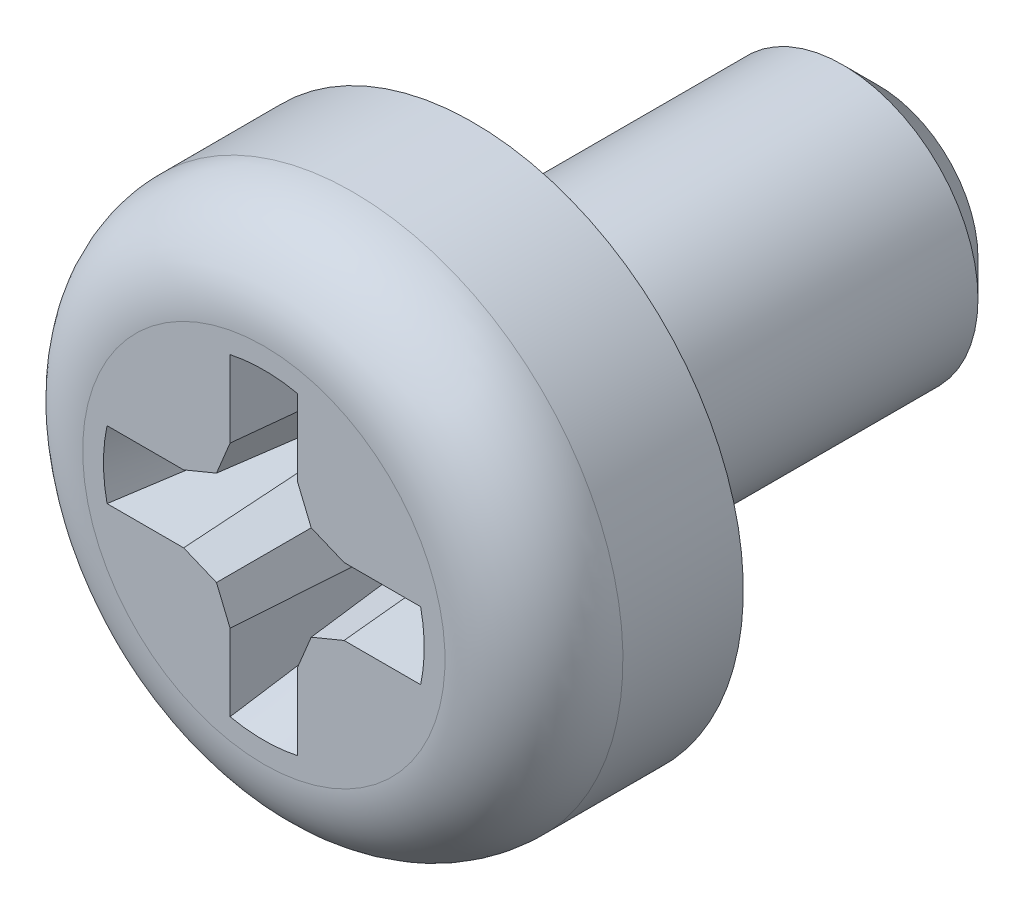
ISO-10303-21;
HEADER;
FILE_DESCRIPTION(('STEP AP214'),'2;1');
FILE_NAME('part.step','',(''),(''),'','','');
FILE_SCHEMA(('AUTOMOTIVE_DESIGN { 1 0 10303 214 1 1 1 1 }'));
ENDSEC;
DATA;
#1=APPLICATION_CONTEXT('core data for automotive mechanical design processes');
#2=APPLICATION_PROTOCOL_DEFINITION('international standard','automotive_design',2000,#1);
#3=PRODUCT_CONTEXT('',#1,'mechanical');
#4=PRODUCT('Part','Part','',(#3));
#5=PRODUCT_RELATED_PRODUCT_CATEGORY('part','',(#4));
#6=PRODUCT_DEFINITION_FORMATION('','',#4);
#7=PRODUCT_DEFINITION_CONTEXT('part definition',#1,'design');
#8=PRODUCT_DEFINITION('design','',#6,#7);
#9=PRODUCT_DEFINITION_SHAPE('','',#8);
#10=(LENGTH_UNIT() NAMED_UNIT(*) SI_UNIT(.MILLI.,.METRE.));
#11=(NAMED_UNIT(*) PLANE_ANGLE_UNIT() SI_UNIT($,.RADIAN.));
#12=(NAMED_UNIT(*) SI_UNIT($,.STERADIAN.) SOLID_ANGLE_UNIT());
#13=UNCERTAINTY_MEASURE_WITH_UNIT(LENGTH_MEASURE(1.E-05),#10,'distance_accuracy_value','');
#14=(GEOMETRIC_REPRESENTATION_CONTEXT(3) GLOBAL_UNCERTAINTY_ASSIGNED_CONTEXT((#13)) GLOBAL_UNIT_ASSIGNED_CONTEXT((#10,
#11,#12)) REPRESENTATION_CONTEXT('',''));
#15=CARTESIAN_POINT('',(0.,0.,0.));
#16=DIRECTION('',(0.,0.,1.));
#17=DIRECTION('',(1.,0.,0.));
#18=AXIS2_PLACEMENT_3D('',#15,#16,#17);
#19=CARTESIAN_POINT('',(0.,0.,0.));
#20=DIRECTION('',(0.,0.,1.));
#21=DIRECTION('',(1.,0.,0.));
#22=AXIS2_PLACEMENT_3D('',#19,#20,#21);
#23=PLANE('',#22);
#24=CARTESIAN_POINT('',(0.,0.,0.));
#25=DIRECTION('',(0.,0.,1.));
#26=DIRECTION('',(1.,0.,0.));
#27=AXIS2_PLACEMENT_3D('',#24,#25,#26);
#28=CIRCLE('',#27,4.);
#29=CARTESIAN_POINT('',(-4.,0.,0.));
#30=VERTEX_POINT('',#29);
#31=EDGE_CURVE('E56',#30,#30,#28,.T.);
#32=ORIENTED_EDGE('',*,*,#31,.F.);
#33=EDGE_LOOP('',(#32));
#34=FACE_BOUND('',#33,.T.);
#35=CARTESIAN_POINT('',(0.,0.,0.));
#36=DIRECTION('',(0.,0.,1.));
#37=DIRECTION('',(1.,0.,0.));
#38=AXIS2_PLACEMENT_3D('',#35,#36,#37);
#39=CIRCLE('',#38,2.);
#40=CARTESIAN_POINT('',(2.,0.,0.));
#41=VERTEX_POINT('',#40);
#42=EDGE_CURVE('E11',#41,#41,#39,.F.);
#43=ORIENTED_EDGE('',*,*,#42,.F.);
#44=EDGE_LOOP('',(#43));
#45=FACE_BOUND('',#44,.T.);
#46=ADVANCED_FACE('F39',(#34,#45),#23,.F.);
#47=CARTESIAN_POINT('',(0.,0.,3.1));
#48=DIRECTION('',(0.,0.,-1.));
#49=DIRECTION('',(-1.,0.,0.));
#50=AXIS2_PLACEMENT_3D('',#47,#48,#49);
#51=CYLINDRICAL_SURFACE('',#50,4.);
#52=CARTESIAN_POINT('',(0.,0.,1.7825));
#53=DIRECTION('',(0.,0.,-1.));
#54=DIRECTION('',(0.,1.,0.));
#55=AXIS2_PLACEMENT_3D('',#52,#53,#54);
#56=CIRCLE('',#55,4.);
#57=CARTESIAN_POINT('',(-4.,0.,1.7825));
#58=VERTEX_POINT('',#57);
#59=EDGE_CURVE('E456',#58,#58,#56,.T.);
#60=CARTESIAN_POINT('',(-4.,0.,1.7825));
#61=CARTESIAN_POINT('',(-4.,0.,1.76393229166667));
#62=CARTESIAN_POINT('',(-4.,0.,1.74536458333333));
#63=CARTESIAN_POINT('',(-4.,0.,1.70822916666667));
#64=CARTESIAN_POINT('',(-4.,0.,1.68966145833333));
#65=CARTESIAN_POINT('',(-4.,0.,1.65252604166667));
#66=CARTESIAN_POINT('',(-4.,0.,1.63395833333333));
#67=CARTESIAN_POINT('',(-4.,0.,1.59682291666667));
#68=CARTESIAN_POINT('',(-4.,0.,1.57825520833333));
#69=CARTESIAN_POINT('',(-4.,0.,1.54111979166667));
#70=CARTESIAN_POINT('',(-4.,0.,1.52255208333333));
#71=CARTESIAN_POINT('',(-4.,0.,1.48541666666667));
#72=CARTESIAN_POINT('',(-4.,0.,1.46684895833333));
#73=CARTESIAN_POINT('',(-4.,0.,1.42971354166667));
#74=CARTESIAN_POINT('',(-4.,0.,1.41114583333333));
#75=CARTESIAN_POINT('',(-4.,0.,1.37401041666667));
#76=CARTESIAN_POINT('',(-4.,0.,1.35544270833333));
#77=CARTESIAN_POINT('',(-4.,0.,1.31830729166667));
#78=CARTESIAN_POINT('',(-4.,0.,1.29973958333333));
#79=CARTESIAN_POINT('',(-4.,0.,1.26260416666667));
#80=CARTESIAN_POINT('',(-4.,0.,1.24403645833333));
#81=CARTESIAN_POINT('',(-4.,0.,1.20690104166667));
#82=CARTESIAN_POINT('',(-4.,0.,1.18833333333333));
#83=CARTESIAN_POINT('',(-4.,0.,1.15119791666667));
#84=CARTESIAN_POINT('',(-4.,0.,1.13263020833333));
#85=CARTESIAN_POINT('',(-4.,0.,1.09549479166667));
#86=CARTESIAN_POINT('',(-4.,0.,1.07692708333333));
#87=CARTESIAN_POINT('',(-4.,0.,1.03979166666667));
#88=CARTESIAN_POINT('',(-4.,0.,1.02122395833333));
#89=CARTESIAN_POINT('',(-4.,0.,0.984088541666667));
#90=CARTESIAN_POINT('',(-4.,0.,0.965520833333333));
#91=CARTESIAN_POINT('',(-4.,0.,0.928385416666666));
#92=CARTESIAN_POINT('',(-4.,0.,0.909817708333333));
#93=CARTESIAN_POINT('',(-4.,0.,0.872682291666666));
#94=CARTESIAN_POINT('',(-4.,0.,0.854114583333333));
#95=CARTESIAN_POINT('',(-4.,0.,0.816979166666667));
#96=CARTESIAN_POINT('',(-4.,0.,0.798411458333333));
#97=CARTESIAN_POINT('',(-4.,0.,0.761276041666667));
#98=CARTESIAN_POINT('',(-4.,0.,0.742708333333333));
#99=CARTESIAN_POINT('',(-4.,0.,0.705572916666667));
#100=CARTESIAN_POINT('',(-4.,0.,0.687005208333333));
#101=CARTESIAN_POINT('',(-4.,0.,0.649869791666667));
#102=CARTESIAN_POINT('',(-4.,0.,0.631302083333333));
#103=CARTESIAN_POINT('',(-4.,0.,0.594166666666667));
#104=CARTESIAN_POINT('',(-4.,0.,0.575598958333333));
#105=CARTESIAN_POINT('',(-4.,0.,0.538463541666667));
#106=CARTESIAN_POINT('',(-4.,0.,0.519895833333333));
#107=CARTESIAN_POINT('',(-4.,0.,0.482760416666667));
#108=CARTESIAN_POINT('',(-4.,0.,0.464192708333333));
#109=CARTESIAN_POINT('',(-4.,0.,0.427057291666667));
#110=CARTESIAN_POINT('',(-4.,0.,0.408489583333333));
#111=CARTESIAN_POINT('',(-4.,0.,0.371354166666667));
#112=CARTESIAN_POINT('',(-4.,0.,0.352786458333333));
#113=CARTESIAN_POINT('',(-4.,0.,0.315651041666667));
#114=CARTESIAN_POINT('',(-4.,0.,0.297083333333333));
#115=CARTESIAN_POINT('',(-4.,0.,0.259947916666666));
#116=CARTESIAN_POINT('',(-4.,0.,0.241380208333333));
#117=CARTESIAN_POINT('',(-4.,0.,0.204244791666667));
#118=CARTESIAN_POINT('',(-4.,0.,0.185677083333333));
#119=CARTESIAN_POINT('',(-4.,0.,0.148541666666667));
#120=CARTESIAN_POINT('',(-4.,0.,0.129973958333333));
#121=CARTESIAN_POINT('',(-4.,0.,0.0928385416666666));
#122=CARTESIAN_POINT('',(-4.,0.,0.0742708333333332));
#123=CARTESIAN_POINT('',(-4.,0.,0.0371354166666665));
#124=CARTESIAN_POINT('',(-4.,0.,0.0185677083333332));
#125=CARTESIAN_POINT('',(-4.,0.,0.));
#126=B_SPLINE_CURVE_WITH_KNOTS('',3,(#60,#61,#62,#63,#64,#65,#66,#67,#68,#69,#70,#71,#72,#73,
#74,#75,#76,#77,#78,#79,#80,#81,#82,#83,#84,#85,#86,#87,#88,#89,#90,#91,#92,#93,#94,#95,#96,#97,
#98,#99,#100,#101,#102,#103,#104,#105,#106,#107,#108,#109,#110,#111,#112,#113,#114,#115,#116,
#117,#118,#119,#120,#121,#122,#123,#124,#125),.UNSPECIFIED.,.F.,.F.,(4,2,2,2,2,2,2,2,2,2,2,2,2,
2,2,2,2,2,2,2,2,2,2,2,2,2,2,2,2,2,2,2,4),(0.,0.055703125,0.11140625,0.167109375,0.2228125,
0.278515625,0.33421875,0.389921875,0.445625,0.501328125,0.55703125,0.612734375,0.6684375,
0.724140625,0.77984375,0.835546875,0.89125,0.946953125,1.00265625,1.058359375,1.1140625,
1.169765625,1.22546875,1.281171875,1.336875,1.392578125,1.44828125,1.503984375,1.5596875,
1.615390625,1.67109375,1.726796875,1.7825),.UNSPECIFIED.);
#127=EDGE_CURVE('BSEAM382',#58,#30,#126,.T.);
#128=ORIENTED_EDGE('',*,*,#59,.T.);
#129=ORIENTED_EDGE('',*,*,#31,.T.);
#130=ORIENTED_EDGE('',*,*,#127,.T.);
#131=ORIENTED_EDGE('',*,*,#127,.F.);
#132=EDGE_LOOP('',(#128,#130,#129,#131));
#133=FACE_BOUND('',#132,.T.);
#134=ADVANCED_FACE('F382',(#133),#51,.T.);
#135=CARTESIAN_POINT('',(0.,0.,1.7825));
#136=DIRECTION('',(0.,0.,-1.));
#137=DIRECTION('',(0.,1.,0.));
#138=AXIS2_PLACEMENT_3D('',#135,#136,#137);
#139=TOROIDAL_SURFACE('',#138,2.6825,1.3175);
#140=ORIENTED_EDGE('',*,*,#59,.F.);
#141=EDGE_LOOP('',(#140));
#142=FACE_BOUND('',#141,.T.);
#143=CARTESIAN_POINT('',(0.,0.,3.1));
#144=DIRECTION('',(0.,0.,-1.));
#145=DIRECTION('',(0.,1.,0.));
#146=AXIS2_PLACEMENT_3D('',#143,#144,#145);
#147=CIRCLE('',#146,2.6825);
#148=CARTESIAN_POINT('',(0.,2.6825,3.1));
#149=VERTEX_POINT('',#148);
#150=EDGE_CURVE('E452',#149,#149,#147,.T.);
#151=ORIENTED_EDGE('',*,*,#150,.T.);
#152=EDGE_LOOP('',(#151));
#153=FACE_BOUND('',#152,.T.);
#154=ADVANCED_FACE('F388',(#142,#153),#139,.T.);
#155=CARTESIAN_POINT('',(0.,0.,3.1));
#156=DIRECTION('',(0.,0.,1.));
#157=DIRECTION('',(1.,0.,0.));
#158=AXIS2_PLACEMENT_3D('',#155,#156,#157);
#159=PLANE('',#158);
#160=DIRECTION('',(0.,-1.,0.));
#161=VECTOR('',#160,1.);
#162=CARTESIAN_POINT('',(-0.500000000000005,1.1875,3.1));
#163=LINE('',#162,#161);
#164=CARTESIAN_POINT('',(-0.500000000000009,2.32177195262584,3.1));
#165=VERTEX_POINT('',#164);
#166=CARTESIAN_POINT('',(-0.500000000000005,1.1875,3.1));
#167=VERTEX_POINT('',#166);
#168=EDGE_CURVE('E337',#165,#167,#163,.T.);
#169=ORIENTED_EDGE('',*,*,#168,.F.);
#170=CARTESIAN_POINT('',(0.,0.,3.1));
#171=DIRECTION('',(0.,0.,1.));
#172=DIRECTION('',(1.,0.,0.));
#173=AXIS2_PLACEMENT_3D('',#170,#171,#172);
#174=CIRCLE('',#173,2.375);
#175=CARTESIAN_POINT('',(0.5,2.32177195262584,3.1));
#176=VERTEX_POINT('',#175);
#177=EDGE_CURVE('E344',#176,#165,#174,.T.);
#178=ORIENTED_EDGE('',*,*,#177,.F.);
#179=DIRECTION('',(0.,1.,0.));
#180=VECTOR('',#179,1.);
#181=CARTESIAN_POINT('',(0.5,2.32177195262584,3.1));
#182=LINE('',#181,#180);
#183=CARTESIAN_POINT('',(0.5,1.1875,3.1));
#184=VERTEX_POINT('',#183);
#185=EDGE_CURVE('E440',#184,#176,#182,.T.);
#186=ORIENTED_EDGE('',*,*,#185,.F.);
#187=DIRECTION('',(-0.382683432365083,0.923879532511289,0.));
#188=VECTOR('',#187,1.);
#189=CARTESIAN_POINT('',(0.5,1.1875,3.1));
#190=LINE('',#189,#188);
#191=CARTESIAN_POINT('',(0.701364087934246,0.701364087934246,3.1));
#192=VERTEX_POINT('',#191);
#193=EDGE_CURVE('E434',#192,#184,#190,.T.);
#194=ORIENTED_EDGE('',*,*,#193,.F.);
#195=DIRECTION('',(-0.92387953251129,0.382683432365083,0.));
#196=VECTOR('',#195,1.);
#197=CARTESIAN_POINT('',(1.1875,0.500000000000001,3.1));
#198=LINE('',#197,#196);
#199=CARTESIAN_POINT('',(1.1875,0.500000000000001,3.1));
#200=VERTEX_POINT('',#199);
#201=EDGE_CURVE('E193',#200,#192,#198,.T.);
#202=ORIENTED_EDGE('',*,*,#201,.F.);
#203=DIRECTION('',(-1.,0.,0.));
#204=VECTOR('',#203,1.);
#205=CARTESIAN_POINT('',(1.1875,0.500000000000001,3.1));
#206=LINE('',#205,#204);
#207=CARTESIAN_POINT('',(2.32177195262584,0.500000000000001,3.1));
#208=VERTEX_POINT('',#207);
#209=EDGE_CURVE('E426',#208,#200,#206,.T.);
#210=ORIENTED_EDGE('',*,*,#209,.F.);
#211=CARTESIAN_POINT('',(0.,0.,3.1));
#212=DIRECTION('',(0.,0.,1.));
#213=DIRECTION('',(1.,0.,0.));
#214=AXIS2_PLACEMENT_3D('',#211,#212,#213);
#215=CIRCLE('',#214,2.375);
#216=CARTESIAN_POINT('',(2.32177195262584,-0.499999999999976,3.1));
#217=VERTEX_POINT('',#216);
#218=EDGE_CURVE('E290',#217,#208,#215,.T.);
#219=ORIENTED_EDGE('',*,*,#218,.F.);
#220=DIRECTION('',(1.,0.,0.));
#221=VECTOR('',#220,1.);
#222=CARTESIAN_POINT('',(2.32177195262584,-0.499999999999976,3.1));
#223=LINE('',#222,#221);
#224=CARTESIAN_POINT('',(1.1875,-0.499999999999988,3.1));
#225=VERTEX_POINT('',#224);
#226=EDGE_CURVE('E519',#225,#217,#223,.T.);
#227=ORIENTED_EDGE('',*,*,#226,.F.);
#228=DIRECTION('',(0.923879532511285,0.382683432365093,0.));
#229=VECTOR('',#228,1.);
#230=CARTESIAN_POINT('',(1.1875,-0.499999999999988,3.1));
#231=LINE('',#230,#229);
#232=CARTESIAN_POINT('',(0.701364087934254,-0.701364087934238,3.1));
#233=VERTEX_POINT('',#232);
#234=EDGE_CURVE('E522',#233,#225,#231,.T.);
#235=ORIENTED_EDGE('',*,*,#234,.F.);
#236=DIRECTION('',(0.382683432365073,0.923879532511294,0.));
#237=VECTOR('',#236,1.);
#238=CARTESIAN_POINT('',(0.500000000000013,-1.18749999999999,3.1));
#239=LINE('',#238,#237);
#240=CARTESIAN_POINT('',(0.500000000000013,-1.18749999999999,3.1));
#241=VERTEX_POINT('',#240);
#242=EDGE_CURVE('E525',#241,#233,#239,.T.);
#243=ORIENTED_EDGE('',*,*,#242,.F.);
#244=DIRECTION('',(0.,1.,0.));
#245=VECTOR('',#244,1.);
#246=CARTESIAN_POINT('',(0.500000000000013,-1.18749999999999,3.1));
#247=LINE('',#246,#245);
#248=CARTESIAN_POINT('',(0.500000000000025,-2.32177195262583,3.1));
#249=VERTEX_POINT('',#248);
#250=EDGE_CURVE('E528',#249,#241,#247,.T.);
#251=ORIENTED_EDGE('',*,*,#250,.F.);
#252=CARTESIAN_POINT('',(0.,0.,3.1));
#253=DIRECTION('',(0.,0.,1.));
#254=DIRECTION('',(-1.,0.,0.));
#255=AXIS2_PLACEMENT_3D('',#252,#253,#254);
#256=CIRCLE('',#255,2.375);
#257=CARTESIAN_POINT('',(-0.499999999999984,-2.32177195262584,3.1));
#258=VERTEX_POINT('',#257);
#259=EDGE_CURVE('E499',#258,#249,#256,.T.);
#260=ORIENTED_EDGE('',*,*,#259,.F.);
#261=DIRECTION('',(0.,-1.,0.));
#262=VECTOR('',#261,1.);
#263=CARTESIAN_POINT('',(-0.499999999999984,-2.32177195262584,3.1));
#264=LINE('',#263,#262);
#265=CARTESIAN_POINT('',(-0.499999999999992,-1.1875,3.1));
#266=VERTEX_POINT('',#265);
#267=EDGE_CURVE('E503',#266,#258,#264,.T.);
#268=ORIENTED_EDGE('',*,*,#267,.F.);
#269=DIRECTION('',(0.382683432365089,-0.923879532511287,0.));
#270=VECTOR('',#269,1.);
#271=CARTESIAN_POINT('',(-0.499999999999992,-1.1875,3.1));
#272=LINE('',#271,#270);
#273=CARTESIAN_POINT('',(-0.701364087934241,-0.701364087934251,3.1));
#274=VERTEX_POINT('',#273);
#275=EDGE_CURVE('E507',#274,#266,#272,.T.);
#276=ORIENTED_EDGE('',*,*,#275,.F.);
#277=DIRECTION('',(0.923879532511292,-0.382683432365076,0.));
#278=VECTOR('',#277,1.);
#279=CARTESIAN_POINT('',(-1.1875,-0.500000000000009,3.1));
#280=LINE('',#279,#278);
#281=CARTESIAN_POINT('',(-1.1875,-0.500000000000009,3.1));
#282=VERTEX_POINT('',#281);
#283=EDGE_CURVE('E511',#282,#274,#280,.T.);
#284=ORIENTED_EDGE('',*,*,#283,.F.);
#285=DIRECTION('',(1.,0.,0.));
#286=VECTOR('',#285,1.);
#287=CARTESIAN_POINT('',(-1.1875,-0.500000000000009,3.1));
#288=LINE('',#287,#286);
#289=CARTESIAN_POINT('',(-2.32177195262584,-0.500000000000017,3.1));
#290=VERTEX_POINT('',#289);
#291=EDGE_CURVE('E515',#290,#282,#288,.T.);
#292=ORIENTED_EDGE('',*,*,#291,.F.);
#293=CARTESIAN_POINT('',(0.,0.,3.1));
#294=DIRECTION('',(0.,0.,1.));
#295=DIRECTION('',(0.,1.,0.));
#296=AXIS2_PLACEMENT_3D('',#293,#294,#295);
#297=CIRCLE('',#296,2.375);
#298=CARTESIAN_POINT('',(-2.32177195262584,0.499999999999992,3.1));
#299=VERTEX_POINT('',#298);
#300=EDGE_CURVE('E138',#299,#290,#297,.T.);
#301=ORIENTED_EDGE('',*,*,#300,.F.);
#302=DIRECTION('',(-1.,0.,0.));
#303=VECTOR('',#302,1.);
#304=CARTESIAN_POINT('',(-2.32177195262584,0.499999999999992,3.1));
#305=LINE('',#304,#303);
#306=CARTESIAN_POINT('',(-1.1875,0.499999999999996,3.1));
#307=VERTEX_POINT('',#306);
#308=EDGE_CURVE('E484',#307,#299,#305,.T.);
#309=ORIENTED_EDGE('',*,*,#308,.F.);
#310=DIRECTION('',(-0.923879532511288,-0.382683432365086,0.));
#311=VECTOR('',#310,1.);
#312=CARTESIAN_POINT('',(-1.1875,0.499999999999996,3.1));
#313=LINE('',#312,#311);
#314=CARTESIAN_POINT('',(-0.701364087934249,0.701364087934243,3.1));
#315=VERTEX_POINT('',#314);
#316=EDGE_CURVE('E487',#315,#307,#313,.T.);
#317=ORIENTED_EDGE('',*,*,#316,.F.);
#318=DIRECTION('',(-0.38268343236508,-0.923879532511291,0.));
#319=VECTOR('',#318,1.);
#320=CARTESIAN_POINT('',(-0.500000000000005,1.1875,3.1));
#321=LINE('',#320,#319);
#322=EDGE_CURVE('E493',#167,#315,#321,.T.);
#323=ORIENTED_EDGE('',*,*,#322,.F.);
#324=EDGE_LOOP('',(#169,#178,#186,#194,#202,#210,#219,#227,#235,#243,#251,#260,#268,#276,#284,
#292,#301,#309,#317,#323));
#325=FACE_BOUND('',#324,.T.);
#326=ORIENTED_EDGE('',*,*,#150,.F.);
#327=EDGE_LOOP('',(#326));
#328=FACE_BOUND('',#327,.T.);
#329=ADVANCED_FACE('F393',(#325,#328),#159,.T.);
#330=CARTESIAN_POINT('',(0.,0.,-6.));
#331=DIRECTION('',(0.,0.,1.));
#332=DIRECTION('',(1.,0.,0.));
#333=AXIS2_PLACEMENT_3D('',#330,#331,#332);
#334=PLANE('',#333);
#335=CARTESIAN_POINT('',(0.,0.,-6.));
#336=DIRECTION('',(0.,0.,1.));
#337=DIRECTION('',(1.,0.,0.));
#338=AXIS2_PLACEMENT_3D('',#335,#336,#337);
#339=CIRCLE('',#338,1.475);
#340=CARTESIAN_POINT('',(1.475,0.,-6.));
#341=VERTEX_POINT('',#340);
#342=EDGE_CURVE('E448',#341,#341,#339,.F.);
#343=ORIENTED_EDGE('',*,*,#342,.T.);
#344=EDGE_LOOP('',(#343));
#345=FACE_BOUND('',#344,.T.);
#346=ADVANCED_FACE('F396',(#345),#334,.F.);
#347=CARTESIAN_POINT('',(0.,0.,0.));
#348=DIRECTION('',(0.,0.,1.));
#349=DIRECTION('',(1.,0.,0.));
#350=AXIS2_PLACEMENT_3D('',#347,#348,#349);
#351=CYLINDRICAL_SURFACE('',#350,2.);
#352=CARTESIAN_POINT('',(0.,0.,-5.475));
#353=DIRECTION('',(0.,0.,1.));
#354=DIRECTION('',(1.,0.,0.));
#355=AXIS2_PLACEMENT_3D('',#352,#353,#354);
#356=CIRCLE('',#355,2.);
#357=CARTESIAN_POINT('',(2.,0.,-5.475));
#358=VERTEX_POINT('',#357);
#359=EDGE_CURVE('E229',#358,#358,#356,.T.);
#360=ORIENTED_EDGE('',*,*,#359,.T.);
#361=EDGE_LOOP('',(#360));
#362=FACE_BOUND('',#361,.T.);
#363=ORIENTED_EDGE('',*,*,#42,.T.);
#364=EDGE_LOOP('',(#363));
#365=FACE_BOUND('',#364,.T.);
#366=ADVANCED_FACE('F403',(#362,#365),#351,.T.);
#367=CARTESIAN_POINT('',(0.,0.,-5.475));
#368=DIRECTION('',(0.,0.,1.));
#369=DIRECTION('',(1.,0.,0.));
#370=AXIS2_PLACEMENT_3D('',#367,#368,#369);
#371=CONICAL_SURFACE('',#370,2.,0.785398163397449);
#372=ORIENTED_EDGE('',*,*,#342,.F.);
#373=EDGE_LOOP('',(#372));
#374=FACE_BOUND('',#373,.T.);
#375=ORIENTED_EDGE('',*,*,#359,.F.);
#376=EDGE_LOOP('',(#375));
#377=FACE_BOUND('',#376,.T.);
#378=ADVANCED_FACE('F238',(#374,#377),#371,.T.);
#379=CARTESIAN_POINT('',(0.,0.,3.1));
#380=DIRECTION('',(0.,0.,1.));
#381=DIRECTION('',(1.,0.,0.));
#382=AXIS2_PLACEMENT_3D('',#379,#380,#381);
#383=CONICAL_SURFACE('',#382,2.375,0.26179938779915);
#384=ORIENTED_EDGE('',*,*,#177,.T.);
#385=CARTESIAN_POINT('',(-0.500000000000009,2.32177195262584,3.1));
#386=CARTESIAN_POINT('',(-0.47343930678139,2.24427703480566,2.79640988731358));
#387=CARTESIAN_POINT('',(-0.446879730252152,2.16673165946756,2.49283253844521));
#388=CARTESIAN_POINT('',(-0.393764081079549,2.01148388565445,1.88571789030724));
#389=CARTESIAN_POINT('',(-0.367208008434063,1.93378148727489,1.58218059101342));
#390=CARTESIAN_POINT('',(-0.314100594056121,1.77816343242277,0.975160067009124));
#391=CARTESIAN_POINT('',(-0.287549252325663,1.70024777586032,0.671676842321505));
#392=CARTESIAN_POINT('',(-0.234454103493325,1.54407853183752,0.0647965141449838));
#393=CARTESIAN_POINT('',(-0.207910296396182,1.46582494416517,-0.238600589289766));
#394=CARTESIAN_POINT('',(-0.181371669535779,1.38734008699268,-0.541938482347625));
#395=B_SPLINE_CURVE_WITH_KNOTS('',3,(#385,#386,#387,#388,#389,#390,#391,#392,#393,#394),
.UNSPECIFIED.,.F.,.F.,(4,2,2,2,4),(0.,0.943345660311494,1.88669074731104,2.83003623194303,
3.77338230842007),.UNSPECIFIED.);
#396=CARTESIAN_POINT('',(-0.269467371609197,1.64705627783094,0.465));
#397=VERTEX_POINT('',#396);
#398=EDGE_CURVE('E247',#397,#165,#395,.F.);
#399=ORIENTED_EDGE('',*,*,#398,.F.);
#400=CARTESIAN_POINT('',(0.,0.,0.465));
#401=DIRECTION('',(0.,0.,1.));
#402=DIRECTION('',(1.,0.,0.));
#403=AXIS2_PLACEMENT_3D('',#400,#401,#402);
#404=CIRCLE('',#403,1.66895387794399);
#405=CARTESIAN_POINT('',(0.26946737160919,1.64705627783094,0.465));
#406=VERTEX_POINT('',#405);
#407=EDGE_CURVE('E220',#406,#397,#404,.T.);
#408=ORIENTED_EDGE('',*,*,#407,.F.);
#409=CARTESIAN_POINT('',(0.26946737160919,1.64705627783094,0.465));
#410=CARTESIAN_POINT('',(0.28867325225766,1.70351500535314,0.684524220332607));
#411=CARTESIAN_POINT('',(0.307880871567887,1.75989578614274,0.904068313660021));
#412=CARTESIAN_POINT('',(0.346298880089182,1.8725328045999,1.34318816042636));
#413=CARTESIAN_POINT('',(0.3655092692997,1.9287890422922,1.56276391385898));
#414=CARTESIAN_POINT('',(0.403932116044099,2.04120834207889,2.00193906176845));
#415=CARTESIAN_POINT('',(0.423144573577789,2.09737140418194,2.2215384562431));
#416=CARTESIAN_POINT('',(0.461571147425222,2.20962295987111,2.66075620513519));
#417=CARTESIAN_POINT('',(0.480785263739293,2.26571145344256,2.88037455955635));
#418=CARTESIAN_POINT('',(0.5,2.32177195262584,3.1));
#419=B_SPLINE_CURVE_WITH_KNOTS('',3,(#409,#410,#411,#412,#413,#414,#415,#416,#417,#418),
.UNSPECIFIED.,.F.,.F.,(4,2,2,2,4),(0.,0.682441186737258,1.36488223792859,2.04732322572323,
2.72976434777311),.UNSPECIFIED.);
#420=EDGE_CURVE('E65',#406,#176,#419,.T.);
#421=ORIENTED_EDGE('',*,*,#420,.T.);
#422=EDGE_LOOP('',(#384,#399,#408,#421));
#423=FACE_BOUND('',#422,.T.);
#424=ADVANCED_FACE('F235',(#423),#383,.F.);
#425=CARTESIAN_POINT('',(0.5,2.32177195262584,3.1));
#426=DIRECTION('',(-0.996194698091746,0.,0.0871557427476584));
#427=DIRECTION('',(0.0871557427476584,0.,0.996194698091746));
#428=AXIS2_PLACEMENT_3D('',#425,#426,#427);
#429=PLANE('',#428);
#430=ORIENTED_EDGE('',*,*,#185,.T.);
#431=ORIENTED_EDGE('',*,*,#420,.F.);
#432=DIRECTION('',(0.,-1.,0.));
#433=VECTOR('',#432,1.);
#434=CARTESIAN_POINT('',(0.26946737160919,0.,0.465));
#435=LINE('',#434,#433);
#436=CARTESIAN_POINT('',(0.26946737160919,1.14164420912853,0.465));
#437=VERTEX_POINT('',#436);
#438=EDGE_CURVE('E207',#437,#406,#435,.F.);
#439=ORIENTED_EDGE('',*,*,#438,.F.);
#440=DIRECTION('',(0.0871426484044397,0.01733375049386,0.996045029063886));
#441=VECTOR('',#440,1.);
#442=CARTESIAN_POINT('',(0.501713327907611,1.1878408021102,3.11958342759577));
#443=LINE('',#442,#441);
#444=EDGE_CURVE('E198',#437,#184,#443,.T.);
#445=ORIENTED_EDGE('',*,*,#444,.T.);
#446=EDGE_LOOP('',(#430,#431,#439,#445));
#447=FACE_BOUND('',#446,.T.);
#448=ADVANCED_FACE('F231',(#447),#429,.T.);
#449=CARTESIAN_POINT('',(0.5,1.1875,3.1));
#450=DIRECTION('',(-0.920363891963227,-0.381227206369647,0.0871557427476584));
#451=DIRECTION('',(0.382683432365083,-0.92387953251129,0.));
#452=AXIS2_PLACEMENT_3D('',#449,#450,#451);
#453=PLANE('',#452);
#454=ORIENTED_EDGE('',*,*,#193,.T.);
#455=ORIENTED_EDGE('',*,*,#444,.F.);
#456=DIRECTION('',(0.382683432365083,-0.92387953251129,0.));
#457=VECTOR('',#456,1.);
#458=CARTESIAN_POINT('',(0.633636969679846,0.262461026462376,0.465));
#459=LINE('',#458,#457);
#460=CARTESIAN_POINT('',(0.524922052924763,0.524922052924764,0.465));
#461=VERTEX_POINT('',#460);
#462=EDGE_CURVE('E202',#461,#437,#459,.F.);
#463=ORIENTED_EDGE('',*,*,#462,.F.);
#464=DIRECTION('',(0.0666626913468326,0.0666626913468325,0.995546167269401));
#465=VECTOR('',#464,1.);
#466=CARTESIAN_POINT('',(0.702629589549231,0.702629589549231,3.11889910618695));
#467=LINE('',#466,#465);
#468=EDGE_CURVE('E186',#461,#192,#467,.T.);
#469=ORIENTED_EDGE('',*,*,#468,.T.);
#470=EDGE_LOOP('',(#454,#455,#463,#469));
#471=FACE_BOUND('',#470,.T.);
#472=ADVANCED_FACE('F203',(#471),#453,.T.);
#473=CARTESIAN_POINT('',(1.1875,0.500000000000001,3.1));
#474=DIRECTION('',(-0.381227206369647,-0.920363891963227,0.0871557427476584));
#475=DIRECTION('',(0.92387953251129,-0.382683432365083,0.));
#476=AXIS2_PLACEMENT_3D('',#473,#474,#475);
#477=PLANE('',#476);
#478=ORIENTED_EDGE('',*,*,#201,.T.);
#479=ORIENTED_EDGE('',*,*,#468,.F.);
#480=DIRECTION('',(0.92387953251129,-0.382683432365083,0.));
#481=VECTOR('',#480,1.);
#482=CARTESIAN_POINT('',(0.262461026462376,0.633636969679846,0.465));
#483=LINE('',#482,#481);
#484=CARTESIAN_POINT('',(1.14164420912853,0.269467371609191,0.465));
#485=VERTEX_POINT('',#484);
#486=EDGE_CURVE('E190',#485,#461,#483,.F.);
#487=ORIENTED_EDGE('',*,*,#486,.F.);
#488=DIRECTION('',(0.0173337504938599,0.0871426484044397,0.996045029063886));
#489=VECTOR('',#488,1.);
#490=CARTESIAN_POINT('',(1.1875,0.500000000000001,3.1));
#491=LINE('',#490,#489);
#492=EDGE_CURVE('E199',#485,#200,#491,.T.);
#493=ORIENTED_EDGE('',*,*,#492,.T.);
#494=EDGE_LOOP('',(#478,#479,#487,#493));
#495=FACE_BOUND('',#494,.T.);
#496=ADVANCED_FACE('F188',(#495),#477,.T.);
#497=CARTESIAN_POINT('',(1.1875,0.500000000000001,3.1));
#498=DIRECTION('',(0.,-0.996194698091746,0.0871557427476584));
#499=DIRECTION('',(0.,-0.0871557427476584,-0.996194698091746));
#500=AXIS2_PLACEMENT_3D('',#497,#498,#499);
#501=PLANE('',#500);
#502=ORIENTED_EDGE('',*,*,#209,.T.);
#503=ORIENTED_EDGE('',*,*,#492,.F.);
#504=DIRECTION('',(1.,0.,0.));
#505=VECTOR('',#504,1.);
#506=CARTESIAN_POINT('',(0.,0.269467371609191,0.465));
#507=LINE('',#506,#505);
#508=CARTESIAN_POINT('',(1.64705627783094,0.269467371609191,0.465));
#509=VERTEX_POINT('',#508);
#510=EDGE_CURVE('E211',#509,#485,#507,.F.);
#511=ORIENTED_EDGE('',*,*,#510,.F.);
#512=CARTESIAN_POINT('',(2.32177195262584,0.500000000000001,3.1));
#513=CARTESIAN_POINT('',(2.24427703480566,0.473439306781382,2.79640988731358));
#514=CARTESIAN_POINT('',(2.16673165946756,0.446879730252145,2.49283253844521));
#515=CARTESIAN_POINT('',(2.01148388565445,0.393764081079542,1.88571789030724));
#516=CARTESIAN_POINT('',(1.93378148727489,0.367208008434057,1.58218059101342));
#517=CARTESIAN_POINT('',(1.77816343242277,0.314100594056115,0.975160067009124));
#518=CARTESIAN_POINT('',(1.70024777586033,0.287549252325657,0.671676842321504));
#519=CARTESIAN_POINT('',(1.54407853183752,0.234454103493319,0.0647965141449839));
#520=CARTESIAN_POINT('',(1.46582494416517,0.207910296396176,-0.238600589289766));
#521=CARTESIAN_POINT('',(1.38734008699268,0.181371669535775,-0.541938482347625));
#522=B_SPLINE_CURVE_WITH_KNOTS('',3,(#512,#513,#514,#515,#516,#517,#518,#519,#520,#521),
.UNSPECIFIED.,.F.,.F.,(4,2,2,2,4),(0.,0.943345660311494,1.88669074731104,2.83003623194303,
3.77338230842007),.UNSPECIFIED.);
#523=EDGE_CURVE('E422',#509,#208,#522,.F.);
#524=ORIENTED_EDGE('',*,*,#523,.T.);
#525=EDGE_LOOP('',(#502,#503,#511,#524));
#526=FACE_BOUND('',#525,.T.);
#527=ADVANCED_FACE('F243',(#526),#501,.T.);
#528=CARTESIAN_POINT('',(0.,0.,3.1));
#529=DIRECTION('',(0.,0.,1.));
#530=DIRECTION('',(1.,0.,0.));
#531=AXIS2_PLACEMENT_3D('',#528,#529,#530);
#532=CONICAL_SURFACE('',#531,2.375,0.26179938779915);
#533=ORIENTED_EDGE('',*,*,#218,.T.);
#534=ORIENTED_EDGE('',*,*,#523,.F.);
#535=CARTESIAN_POINT('',(0.,0.,0.465));
#536=DIRECTION('',(0.,0.,1.));
#537=DIRECTION('',(1.,0.,0.));
#538=AXIS2_PLACEMENT_3D('',#535,#536,#537);
#539=CIRCLE('',#538,1.66895387794399);
#540=CARTESIAN_POINT('',(1.64705627783094,-0.269467371609173,0.465));
#541=VERTEX_POINT('',#540);
#542=EDGE_CURVE('E129',#541,#509,#539,.T.);
#543=ORIENTED_EDGE('',*,*,#542,.F.);
#544=CARTESIAN_POINT('',(1.64705627783094,-0.269467371609173,0.465));
#545=CARTESIAN_POINT('',(1.70351500535315,-0.288673252257643,0.684524220332607));
#546=CARTESIAN_POINT('',(1.75989578614274,-0.307880871567868,0.904068313660021));
#547=CARTESIAN_POINT('',(1.8725328045999,-0.346298880089162,1.34318816042636));
#548=CARTESIAN_POINT('',(1.9287890422922,-0.36550926929968,1.56276391385898));
#549=CARTESIAN_POINT('',(2.04120834207889,-0.403932116044078,2.00193906176845));
#550=CARTESIAN_POINT('',(2.09737140418194,-0.423144573577767,2.2215384562431));
#551=CARTESIAN_POINT('',(2.20962295987111,-0.461571147425199,2.66075620513519));
#552=CARTESIAN_POINT('',(2.26571145344256,-0.480785263739269,2.88037455955635));
#553=CARTESIAN_POINT('',(2.32177195262584,-0.499999999999976,3.1));
#554=B_SPLINE_CURVE_WITH_KNOTS('',3,(#544,#545,#546,#547,#548,#549,#550,#551,#552,#553),
.UNSPECIFIED.,.F.,.F.,(4,2,2,2,4),(0.,0.682441186737258,1.36488223792859,2.04732322572323,
2.72976434777311),.UNSPECIFIED.);
#555=EDGE_CURVE('E43',#541,#217,#554,.T.);
#556=ORIENTED_EDGE('',*,*,#555,.T.);
#557=EDGE_LOOP('',(#533,#534,#543,#556));
#558=FACE_BOUND('',#557,.T.);
#559=ADVANCED_FACE('F240',(#558),#532,.F.);
#560=CARTESIAN_POINT('',(0.,0.,0.465));
#561=DIRECTION('',(0.,0.,1.));
#562=DIRECTION('',(1.,0.,0.));
#563=AXIS2_PLACEMENT_3D('',#560,#561,#562);
#564=PLANE('',#563);
#565=ORIENTED_EDGE('',*,*,#407,.T.);
#566=DIRECTION('',(0.,1.,0.));
#567=VECTOR('',#566,1.);
#568=CARTESIAN_POINT('',(-0.269467371609191,0.,0.465));
#569=LINE('',#568,#567);
#570=CARTESIAN_POINT('',(-0.269467371609195,1.14164420912853,0.465));
#571=VERTEX_POINT('',#570);
#572=EDGE_CURVE('E261',#397,#571,#569,.F.);
#573=ORIENTED_EDGE('',*,*,#572,.T.);
#574=DIRECTION('',(0.38268343236508,0.923879532511291,0.));
#575=VECTOR('',#574,1.);
#576=CARTESIAN_POINT('',(-0.633636969679847,0.262461026462374,0.465));
#577=LINE('',#576,#575);
#578=CARTESIAN_POINT('',(-0.524922052924765,0.524922052924761,0.465));
#579=VERTEX_POINT('',#578);
#580=EDGE_CURVE('E480',#571,#579,#577,.F.);
#581=ORIENTED_EDGE('',*,*,#580,.T.);
#582=DIRECTION('',(0.923879532511288,0.382683432365086,0.));
#583=VECTOR('',#582,1.);
#584=CARTESIAN_POINT('',(-0.262461026462378,0.633636969679845,0.465));
#585=LINE('',#584,#583);
#586=CARTESIAN_POINT('',(-1.14164420912853,0.269467371609186,0.465));
#587=VERTEX_POINT('',#586);
#588=EDGE_CURVE('E483',#579,#587,#585,.F.);
#589=ORIENTED_EDGE('',*,*,#588,.T.);
#590=DIRECTION('',(1.,0.,0.));
#591=VECTOR('',#590,1.);
#592=CARTESIAN_POINT('',(0.,0.26946737160919,0.465));
#593=LINE('',#592,#591);
#594=CARTESIAN_POINT('',(-1.64705627783094,0.269467371609184,0.465));
#595=VERTEX_POINT('',#594);
#596=EDGE_CURVE('E291',#587,#595,#593,.F.);
#597=ORIENTED_EDGE('',*,*,#596,.T.);
#598=CARTESIAN_POINT('',(0.,0.,0.465));
#599=DIRECTION('',(0.,0.,1.));
#600=DIRECTION('',(1.,0.,0.));
#601=AXIS2_PLACEMENT_3D('',#598,#599,#600);
#602=CIRCLE('',#601,1.66895387794399);
#603=CARTESIAN_POINT('',(-1.64705627783094,-0.269467371609202,0.465));
#604=VERTEX_POINT('',#603);
#605=EDGE_CURVE('E258',#595,#604,#602,.T.);
#606=ORIENTED_EDGE('',*,*,#605,.T.);
#607=DIRECTION('',(-1.,0.,0.));
#608=VECTOR('',#607,1.);
#609=CARTESIAN_POINT('',(0.,-0.269467371609191,0.465));
#610=LINE('',#609,#608);
#611=CARTESIAN_POINT('',(-1.14164420912853,-0.269467371609199,0.465));
#612=VERTEX_POINT('',#611);
#613=EDGE_CURVE('E312',#604,#612,#610,.F.);
#614=ORIENTED_EDGE('',*,*,#613,.T.);
#615=DIRECTION('',(-0.923879532511292,0.382683432365076,0.));
#616=VECTOR('',#615,1.);
#617=CARTESIAN_POINT('',(-0.262461026462372,-0.633636969679848,0.465));
#618=LINE('',#617,#616);
#619=CARTESIAN_POINT('',(-0.52492205292476,-0.524922052924767,0.465));
#620=VERTEX_POINT('',#619);
#621=EDGE_CURVE('E766',#612,#620,#618,.F.);
#622=ORIENTED_EDGE('',*,*,#621,.T.);
#623=DIRECTION('',(-0.38268343236509,0.923879532511287,0.));
#624=VECTOR('',#623,1.);
#625=CARTESIAN_POINT('',(-0.633636969679844,-0.262461026462381,0.465));
#626=LINE('',#625,#624);
#627=CARTESIAN_POINT('',(-0.269467371609182,-1.14164420912853,0.465));
#628=VERTEX_POINT('',#627);
#629=EDGE_CURVE('E557',#620,#628,#626,.F.);
#630=ORIENTED_EDGE('',*,*,#629,.T.);
#631=DIRECTION('',(0.,1.,0.));
#632=VECTOR('',#631,1.);
#633=CARTESIAN_POINT('',(-0.26946737160919,0.,0.465));
#634=LINE('',#633,#632);
#635=CARTESIAN_POINT('',(-0.269467371609179,-1.64705627783094,0.465));
#636=VERTEX_POINT('',#635);
#637=EDGE_CURVE('E338',#628,#636,#634,.F.);
#638=ORIENTED_EDGE('',*,*,#637,.T.);
#639=CARTESIAN_POINT('',(0.,0.,0.465));
#640=DIRECTION('',(0.,0.,1.));
#641=DIRECTION('',(1.,0.,0.));
#642=AXIS2_PLACEMENT_3D('',#639,#640,#641);
#643=CIRCLE('',#642,1.66895387794399);
#644=CARTESIAN_POINT('',(0.269467371609208,-1.64705627783094,0.465));
#645=VERTEX_POINT('',#644);
#646=EDGE_CURVE('E309',#636,#645,#643,.T.);
#647=ORIENTED_EDGE('',*,*,#646,.T.);
#648=DIRECTION('',(0.,-1.,0.));
#649=VECTOR('',#648,1.);
#650=CARTESIAN_POINT('',(0.269467371609191,0.,0.465));
#651=LINE('',#650,#649);
#652=CARTESIAN_POINT('',(0.269467371609203,-1.14164420912853,0.465));
#653=VERTEX_POINT('',#652);
#654=EDGE_CURVE('E365',#645,#653,#651,.F.);
#655=ORIENTED_EDGE('',*,*,#654,.T.);
#656=DIRECTION('',(-0.382683432365073,-0.923879532511294,0.));
#657=VECTOR('',#656,1.);
#658=CARTESIAN_POINT('',(0.633636969679849,-0.26246102646237,0.465));
#659=LINE('',#658,#657);
#660=CARTESIAN_POINT('',(0.524922052924769,-0.524922052924757,0.465));
#661=VERTEX_POINT('',#660);
#662=EDGE_CURVE('E774',#653,#661,#659,.F.);
#663=ORIENTED_EDGE('',*,*,#662,.T.);
#664=DIRECTION('',(-0.923879532511286,-0.382683432365093,0.));
#665=VECTOR('',#664,1.);
#666=CARTESIAN_POINT('',(0.262461026462383,-0.633636969679843,0.465));
#667=LINE('',#666,#665);
#668=CARTESIAN_POINT('',(1.14164420912853,-0.269467371609178,0.465));
#669=VERTEX_POINT('',#668);
#670=EDGE_CURVE('E777',#661,#669,#667,.F.);
#671=ORIENTED_EDGE('',*,*,#670,.T.);
#672=DIRECTION('',(-1.,0.,0.));
#673=VECTOR('',#672,1.);
#674=CARTESIAN_POINT('',(0.,-0.269467371609191,0.465));
#675=LINE('',#674,#673);
#676=EDGE_CURVE('E364',#669,#541,#675,.F.);
#677=ORIENTED_EDGE('',*,*,#676,.T.);
#678=ORIENTED_EDGE('',*,*,#542,.T.);
#679=ORIENTED_EDGE('',*,*,#510,.T.);
#680=ORIENTED_EDGE('',*,*,#486,.T.);
#681=ORIENTED_EDGE('',*,*,#462,.T.);
#682=ORIENTED_EDGE('',*,*,#438,.T.);
#683=EDGE_LOOP('',(#565,#573,#581,#589,#597,#606,#614,#622,#630,#638,#647,#655,#663,#671,#677,
#678,#679,#680,#681,#682));
#684=FACE_BOUND('',#683,.T.);
#685=ADVANCED_FACE('F209',(#684),#564,.T.);
#686=CARTESIAN_POINT('',(0.,0.,3.1));
#687=DIRECTION('',(0.,0.,1.));
#688=DIRECTION('',(0.,1.,0.));
#689=AXIS2_PLACEMENT_3D('',#686,#687,#688);
#690=CONICAL_SURFACE('',#689,2.375,0.26179938779915);
#691=ORIENTED_EDGE('',*,*,#300,.T.);
#692=CARTESIAN_POINT('',(-2.32177195262584,-0.500000000000017,3.1));
#693=CARTESIAN_POINT('',(-2.24427703480566,-0.473439306781397,2.79640988731358));
#694=CARTESIAN_POINT('',(-2.16673165946756,-0.44687973025216,2.49283253844521));
#695=CARTESIAN_POINT('',(-2.01148388565444,-0.393764081079556,1.88571789030724));
#696=CARTESIAN_POINT('',(-1.93378148727489,-0.36720800843407,1.58218059101342));
#697=CARTESIAN_POINT('',(-1.77816343242277,-0.314100594056127,0.975160067009124));
#698=CARTESIAN_POINT('',(-1.70024777586032,-0.287549252325669,0.671676842321504));
#699=CARTESIAN_POINT('',(-1.54407853183752,-0.23445410349333,0.064796514144984));
#700=CARTESIAN_POINT('',(-1.46582494416517,-0.207910296396187,-0.238600589289766));
#701=CARTESIAN_POINT('',(-1.38734008699268,-0.181371669535784,-0.541938482347625));
#702=B_SPLINE_CURVE_WITH_KNOTS('',3,(#692,#693,#694,#695,#696,#697,#698,#699,#700,#701),
.UNSPECIFIED.,.F.,.F.,(4,2,2,2,4),(0.,0.943345660311494,1.88669074731104,2.83003623194303,
3.77338230842007),.UNSPECIFIED.);
#703=EDGE_CURVE('E299',#604,#290,#702,.F.);
#704=ORIENTED_EDGE('',*,*,#703,.F.);
#705=ORIENTED_EDGE('',*,*,#605,.F.);
#706=CARTESIAN_POINT('',(-1.64705627783094,0.269467371609184,0.465));
#707=CARTESIAN_POINT('',(-1.70351500535314,0.288673252257654,0.684524220332607));
#708=CARTESIAN_POINT('',(-1.75989578614274,0.30788087156788,0.904068313660021));
#709=CARTESIAN_POINT('',(-1.8725328045999,0.346298880089175,1.34318816042636));
#710=CARTESIAN_POINT('',(-1.9287890422922,0.365509269299693,1.56276391385898));
#711=CARTESIAN_POINT('',(-2.04120834207889,0.403932116044092,2.00193906176845));
#712=CARTESIAN_POINT('',(-2.09737140418194,0.423144573577781,2.2215384562431));
#713=CARTESIAN_POINT('',(-2.20962295987111,0.461571147425215,2.66075620513519));
#714=CARTESIAN_POINT('',(-2.26571145344256,0.480785263739285,2.88037455955635));
#715=CARTESIAN_POINT('',(-2.32177195262584,0.499999999999992,3.1));
#716=B_SPLINE_CURVE_WITH_KNOTS('',3,(#706,#707,#708,#709,#710,#711,#712,#713,#714,#715),
.UNSPECIFIED.,.F.,.F.,(4,2,2,2,4),(0.,0.682441186737258,1.36488223792859,2.04732322572323,
2.72976434777311),.UNSPECIFIED.);
#717=EDGE_CURVE('E282',#595,#299,#716,.T.);
#718=ORIENTED_EDGE('',*,*,#717,.T.);
#719=EDGE_LOOP('',(#691,#704,#705,#718));
#720=FACE_BOUND('',#719,.T.);
#721=ADVANCED_FACE('F278',(#720),#690,.F.);
#722=CARTESIAN_POINT('',(-2.32177195262584,0.499999999999992,3.1));
#723=DIRECTION('',(0.,-0.996194698091746,0.0871557427476584));
#724=DIRECTION('',(0.,-0.0871557427476584,-0.996194698091746));
#725=AXIS2_PLACEMENT_3D('',#722,#723,#724);
#726=PLANE('',#725);
#727=ORIENTED_EDGE('',*,*,#308,.T.);
#728=ORIENTED_EDGE('',*,*,#717,.F.);
#729=ORIENTED_EDGE('',*,*,#596,.F.);
#730=DIRECTION('',(-0.0173337504938603,0.0871426484044396,0.996045029063886));
#731=VECTOR('',#730,1.);
#732=CARTESIAN_POINT('',(-1.1878408021102,0.501713327907607,3.11958342759577));
#733=LINE('',#732,#731);
#734=EDGE_CURVE('E259',#587,#307,#733,.T.);
#735=ORIENTED_EDGE('',*,*,#734,.T.);
#736=EDGE_LOOP('',(#727,#728,#729,#735));
#737=FACE_BOUND('',#736,.T.);
#738=ADVANCED_FACE('F273',(#737),#726,.T.);
#739=CARTESIAN_POINT('',(-1.1875,0.499999999999996,3.1));
#740=DIRECTION('',(0.38122720636965,-0.920363891963226,0.0871557427476584));
#741=DIRECTION('',(0.923879532511288,0.382683432365086,0.));
#742=AXIS2_PLACEMENT_3D('',#739,#740,#741);
#743=PLANE('',#742);
#744=ORIENTED_EDGE('',*,*,#316,.T.);
#745=ORIENTED_EDGE('',*,*,#734,.F.);
#746=ORIENTED_EDGE('',*,*,#588,.F.);
#747=DIRECTION('',(-0.0666626913468328,0.0666626913468323,0.995546167269401));
#748=VECTOR('',#747,1.);
#749=CARTESIAN_POINT('',(-0.702629589549234,0.702629589549228,3.11889910618695));
#750=LINE('',#749,#748);
#751=EDGE_CURVE('E576',#579,#315,#750,.T.);
#752=ORIENTED_EDGE('',*,*,#751,.T.);
#753=EDGE_LOOP('',(#744,#745,#746,#752));
#754=FACE_BOUND('',#753,.T.);
#755=ADVANCED_FACE('F277',(#754),#743,.T.);
#756=CARTESIAN_POINT('',(-0.500000000000005,1.1875,3.1));
#757=DIRECTION('',(0.920363891963229,-0.381227206369643,0.0871557427476584));
#758=DIRECTION('',(0.38268343236508,0.923879532511291,0.));
#759=AXIS2_PLACEMENT_3D('',#756,#757,#758);
#760=PLANE('',#759);
#761=ORIENTED_EDGE('',*,*,#322,.T.);
#762=ORIENTED_EDGE('',*,*,#751,.F.);
#763=ORIENTED_EDGE('',*,*,#580,.F.);
#764=DIRECTION('',(-0.0871426484044397,0.0173337504938596,0.996045029063886));
#765=VECTOR('',#764,1.);
#766=CARTESIAN_POINT('',(-0.500000000000005,1.1875,3.1));
#767=LINE('',#766,#765);
#768=EDGE_CURVE('E257',#571,#167,#767,.T.);
#769=ORIENTED_EDGE('',*,*,#768,.T.);
#770=EDGE_LOOP('',(#761,#762,#763,#769));
#771=FACE_BOUND('',#770,.T.);
#772=ADVANCED_FACE('F269',(#771),#760,.T.);
#773=CARTESIAN_POINT('',(-0.500000000000005,1.1875,3.1));
#774=DIRECTION('',(0.996194698091746,0.,0.0871557427476584));
#775=DIRECTION('',(0.0871557427476584,0.,-0.996194698091746));
#776=AXIS2_PLACEMENT_3D('',#773,#774,#775);
#777=PLANE('',#776);
#778=ORIENTED_EDGE('',*,*,#168,.T.);
#779=ORIENTED_EDGE('',*,*,#768,.F.);
#780=ORIENTED_EDGE('',*,*,#572,.F.);
#781=ORIENTED_EDGE('',*,*,#398,.T.);
#782=EDGE_LOOP('',(#778,#779,#780,#781));
#783=FACE_BOUND('',#782,.T.);
#784=ADVANCED_FACE('F263',(#783),#777,.T.);
#785=CARTESIAN_POINT('',(0.,0.,3.1));
#786=DIRECTION('',(0.,0.,1.));
#787=DIRECTION('',(-1.,0.,0.));
#788=AXIS2_PLACEMENT_3D('',#785,#786,#787);
#789=CONICAL_SURFACE('',#788,2.375,0.26179938779915);
#790=ORIENTED_EDGE('',*,*,#259,.T.);
#791=CARTESIAN_POINT('',(0.500000000000025,-2.32177195262583,3.1));
#792=CARTESIAN_POINT('',(0.473439306781405,-2.24427703480566,2.79640988731358));
#793=CARTESIAN_POINT('',(0.446879730252167,-2.16673165946756,2.49283253844521));
#794=CARTESIAN_POINT('',(0.393764081079563,-2.01148388565444,1.88571789030724));
#795=CARTESIAN_POINT('',(0.367208008434077,-1.93378148727489,1.58218059101342));
#796=CARTESIAN_POINT('',(0.314100594056134,-1.77816343242277,0.975160067009124));
#797=CARTESIAN_POINT('',(0.287549252325675,-1.70024777586032,0.671676842321504));
#798=CARTESIAN_POINT('',(0.234454103493336,-1.54407853183752,0.064796514144984));
#799=CARTESIAN_POINT('',(0.207910296396192,-1.46582494416517,-0.238600589289766));
#800=CARTESIAN_POINT('',(0.181371669535789,-1.38734008699268,-0.541938482347625));
#801=B_SPLINE_CURVE_WITH_KNOTS('',3,(#791,#792,#793,#794,#795,#796,#797,#798,#799,#800),
.UNSPECIFIED.,.F.,.F.,(4,2,2,2,4),(0.,0.943345660311494,1.88669074731104,2.83003623194303,
3.77338230842007),.UNSPECIFIED.);
#802=EDGE_CURVE('E350',#645,#249,#801,.F.);
#803=ORIENTED_EDGE('',*,*,#802,.F.);
#804=ORIENTED_EDGE('',*,*,#646,.F.);
#805=CARTESIAN_POINT('',(-0.269467371609179,-1.64705627783094,0.465));
#806=CARTESIAN_POINT('',(-0.288673252257648,-1.70351500535314,0.684524220332607));
#807=CARTESIAN_POINT('',(-0.307880871567874,-1.75989578614274,0.904068313660021));
#808=CARTESIAN_POINT('',(-0.346298880089169,-1.8725328045999,1.34318816042636));
#809=CARTESIAN_POINT('',(-0.365509269299686,-1.9287890422922,1.56276391385898));
#810=CARTESIAN_POINT('',(-0.403932116044085,-2.04120834207889,2.00193906176845));
#811=CARTESIAN_POINT('',(-0.423144573577774,-2.09737140418194,2.2215384562431));
#812=CARTESIAN_POINT('',(-0.461571147425207,-2.20962295987111,2.66075620513518));
#813=CARTESIAN_POINT('',(-0.480785263739277,-2.26571145344256,2.88037455955635));
#814=CARTESIAN_POINT('',(-0.499999999999984,-2.32177195262584,3.1));
#815=B_SPLINE_CURVE_WITH_KNOTS('',3,(#805,#806,#807,#808,#809,#810,#811,#812,#813,#814),
.UNSPECIFIED.,.F.,.F.,(4,2,2,2,4),(0.,0.682441186737258,1.36488223792859,2.04732322572323,
2.72976434777311),.UNSPECIFIED.);
#816=EDGE_CURVE('E329',#636,#258,#815,.T.);
#817=ORIENTED_EDGE('',*,*,#816,.T.);
#818=EDGE_LOOP('',(#790,#803,#804,#817));
#819=FACE_BOUND('',#818,.T.);
#820=ADVANCED_FACE('F268',(#819),#789,.F.);
#821=CARTESIAN_POINT('',(-0.499999999999984,-2.32177195262584,3.1));
#822=DIRECTION('',(0.996194698091746,0.,0.0871557427476584));
#823=DIRECTION('',(0.0871557427476584,0.,-0.996194698091746));
#824=AXIS2_PLACEMENT_3D('',#821,#822,#823);
#825=PLANE('',#824);
#826=ORIENTED_EDGE('',*,*,#267,.T.);
#827=ORIENTED_EDGE('',*,*,#816,.F.);
#828=ORIENTED_EDGE('',*,*,#637,.F.);
#829=DIRECTION('',(-0.0871426484044396,-0.0173337504938606,0.996045029063886));
#830=VECTOR('',#829,1.);
#831=CARTESIAN_POINT('',(-0.501713327907603,-1.1878408021102,3.11958342759577));
#832=LINE('',#831,#830);
#833=EDGE_CURVE('E310',#628,#266,#832,.T.);
#834=ORIENTED_EDGE('',*,*,#833,.T.);
#835=EDGE_LOOP('',(#826,#827,#828,#834));
#836=FACE_BOUND('',#835,.T.);
#837=ADVANCED_FACE('F321',(#836),#825,.T.);
#838=CARTESIAN_POINT('',(-0.499999999999992,-1.1875,3.1));
#839=DIRECTION('',(0.920363891963224,0.381227206369653,0.0871557427476584));
#840=DIRECTION('',(-0.38268343236509,0.923879532511287,0.));
#841=AXIS2_PLACEMENT_3D('',#838,#839,#840);
#842=PLANE('',#841);
#843=ORIENTED_EDGE('',*,*,#275,.T.);
#844=ORIENTED_EDGE('',*,*,#833,.F.);
#845=ORIENTED_EDGE('',*,*,#629,.F.);
#846=DIRECTION('',(-0.0666626913468321,-0.066662691346833,0.995546167269401));
#847=VECTOR('',#846,1.);
#848=CARTESIAN_POINT('',(-0.702629589549226,-0.702629589549236,3.11889910618695));
#849=LINE('',#848,#847);
#850=EDGE_CURVE('E556',#620,#274,#849,.T.);
#851=ORIENTED_EDGE('',*,*,#850,.T.);
#852=EDGE_LOOP('',(#843,#844,#845,#851));
#853=FACE_BOUND('',#852,.T.);
#854=ADVANCED_FACE('F325',(#853),#842,.T.);
#855=CARTESIAN_POINT('',(-1.1875,-0.500000000000009,3.1));
#856=DIRECTION('',(0.38122720636964,0.92036389196323,0.0871557427476584));
#857=DIRECTION('',(-0.923879532511292,0.382683432365076,0.));
#858=AXIS2_PLACEMENT_3D('',#855,#856,#857);
#859=PLANE('',#858);
#860=ORIENTED_EDGE('',*,*,#283,.T.);
#861=ORIENTED_EDGE('',*,*,#850,.F.);
#862=ORIENTED_EDGE('',*,*,#621,.F.);
#863=DIRECTION('',(-0.0173337504938593,-0.0871426484044398,0.996045029063886));
#864=VECTOR('',#863,1.);
#865=CARTESIAN_POINT('',(-1.1875,-0.500000000000009,3.1));
#866=LINE('',#865,#864);
#867=EDGE_CURVE('E308',#612,#282,#866,.T.);
#868=ORIENTED_EDGE('',*,*,#867,.T.);
#869=EDGE_LOOP('',(#860,#861,#862,#868));
#870=FACE_BOUND('',#869,.T.);
#871=ADVANCED_FACE('F319',(#870),#859,.T.);
#872=CARTESIAN_POINT('',(-1.1875,-0.500000000000009,3.1));
#873=DIRECTION('',(0.,0.996194698091746,0.0871557427476584));
#874=DIRECTION('',(0.,-0.0871557427476584,0.996194698091746));
#875=AXIS2_PLACEMENT_3D('',#872,#873,#874);
#876=PLANE('',#875);
#877=ORIENTED_EDGE('',*,*,#291,.T.);
#878=ORIENTED_EDGE('',*,*,#867,.F.);
#879=ORIENTED_EDGE('',*,*,#613,.F.);
#880=ORIENTED_EDGE('',*,*,#703,.T.);
#881=EDGE_LOOP('',(#877,#878,#879,#880));
#882=FACE_BOUND('',#881,.T.);
#883=ADVANCED_FACE('F314',(#882),#876,.T.);
#884=CARTESIAN_POINT('',(2.32177195262584,-0.499999999999976,3.1));
#885=DIRECTION('',(0.,0.996194698091746,0.0871557427476584));
#886=DIRECTION('',(0.,-0.0871557427476584,0.996194698091746));
#887=AXIS2_PLACEMENT_3D('',#884,#885,#886);
#888=PLANE('',#887);
#889=ORIENTED_EDGE('',*,*,#226,.T.);
#890=ORIENTED_EDGE('',*,*,#555,.F.);
#891=ORIENTED_EDGE('',*,*,#676,.F.);
#892=DIRECTION('',(0.0173337504938609,-0.0871426484044395,0.996045029063886));
#893=VECTOR('',#892,1.);
#894=CARTESIAN_POINT('',(1.1878408021102,-0.501713327907599,3.11958342759577));
#895=LINE('',#894,#893);
#896=EDGE_CURVE('E121',#669,#225,#895,.T.);
#897=ORIENTED_EDGE('',*,*,#896,.T.);
#898=EDGE_LOOP('',(#889,#890,#891,#897));
#899=FACE_BOUND('',#898,.T.);
#900=ADVANCED_FACE('F318',(#899),#888,.T.);
#901=CARTESIAN_POINT('',(1.1875,-0.499999999999988,3.1));
#902=DIRECTION('',(-0.381227206369656,0.920363891963223,0.0871557427476584));
#903=DIRECTION('',(-0.923879532511286,-0.382683432365093,0.));
#904=AXIS2_PLACEMENT_3D('',#901,#902,#903);
#905=PLANE('',#904);
#906=ORIENTED_EDGE('',*,*,#234,.T.);
#907=ORIENTED_EDGE('',*,*,#896,.F.);
#908=ORIENTED_EDGE('',*,*,#670,.F.);
#909=DIRECTION('',(0.0666626913468333,-0.0666626913468319,0.995546167269401));
#910=VECTOR('',#909,1.);
#911=CARTESIAN_POINT('',(0.702629589549239,-0.702629589549223,3.11889910618695));
#912=LINE('',#911,#910);
#913=EDGE_CURVE('E349',#661,#233,#912,.T.);
#914=ORIENTED_EDGE('',*,*,#913,.T.);
#915=EDGE_LOOP('',(#906,#907,#908,#914));
#916=FACE_BOUND('',#915,.T.);
#917=ADVANCED_FACE('F41',(#916),#905,.T.);
#918=CARTESIAN_POINT('',(0.500000000000013,-1.18749999999999,3.1));
#919=DIRECTION('',(-0.920363891963231,0.381227206369637,0.0871557427476584));
#920=DIRECTION('',(-0.382683432365073,-0.923879532511294,0.));
#921=AXIS2_PLACEMENT_3D('',#918,#919,#920);
#922=PLANE('',#921);
#923=ORIENTED_EDGE('',*,*,#242,.T.);
#924=ORIENTED_EDGE('',*,*,#913,.F.);
#925=ORIENTED_EDGE('',*,*,#662,.F.);
#926=DIRECTION('',(0.0871426484044399,-0.017333750493859,0.996045029063886));
#927=VECTOR('',#926,1.);
#928=CARTESIAN_POINT('',(0.500000000000013,-1.18749999999999,3.1));
#929=LINE('',#928,#927);
#930=EDGE_CURVE('E345',#653,#241,#929,.T.);
#931=ORIENTED_EDGE('',*,*,#930,.T.);
#932=EDGE_LOOP('',(#923,#924,#925,#931));
#933=FACE_BOUND('',#932,.T.);
#934=ADVANCED_FACE('F370',(#933),#922,.T.);
#935=CARTESIAN_POINT('',(0.500000000000013,-1.18749999999999,3.1));
#936=DIRECTION('',(-0.996194698091746,0.,0.0871557427476584));
#937=DIRECTION('',(0.0871557427476584,0.,0.996194698091746));
#938=AXIS2_PLACEMENT_3D('',#935,#936,#937);
#939=PLANE('',#938);
#940=ORIENTED_EDGE('',*,*,#250,.T.);
#941=ORIENTED_EDGE('',*,*,#930,.F.);
#942=ORIENTED_EDGE('',*,*,#654,.F.);
#943=ORIENTED_EDGE('',*,*,#802,.T.);
#944=EDGE_LOOP('',(#940,#941,#942,#943));
#945=FACE_BOUND('',#944,.T.);
#946=ADVANCED_FACE('F367',(#945),#939,.T.);
#947=CLOSED_SHELL('',(#46,#134,#154,#329,#346,#366,#378,#424,#448,#472,#496,#527,#559,#685,#721,
#738,#755,#772,#784,#820,#837,#854,#871,#883,#900,#917,#934,#946));
#948=MANIFOLD_SOLID_BREP('B2',#947);
#949=ADVANCED_BREP_SHAPE_REPRESENTATION('',(#18,#948),#14);
#950=SHAPE_DEFINITION_REPRESENTATION(#9,#949);
ENDSEC;
END-ISO-10303-21;
